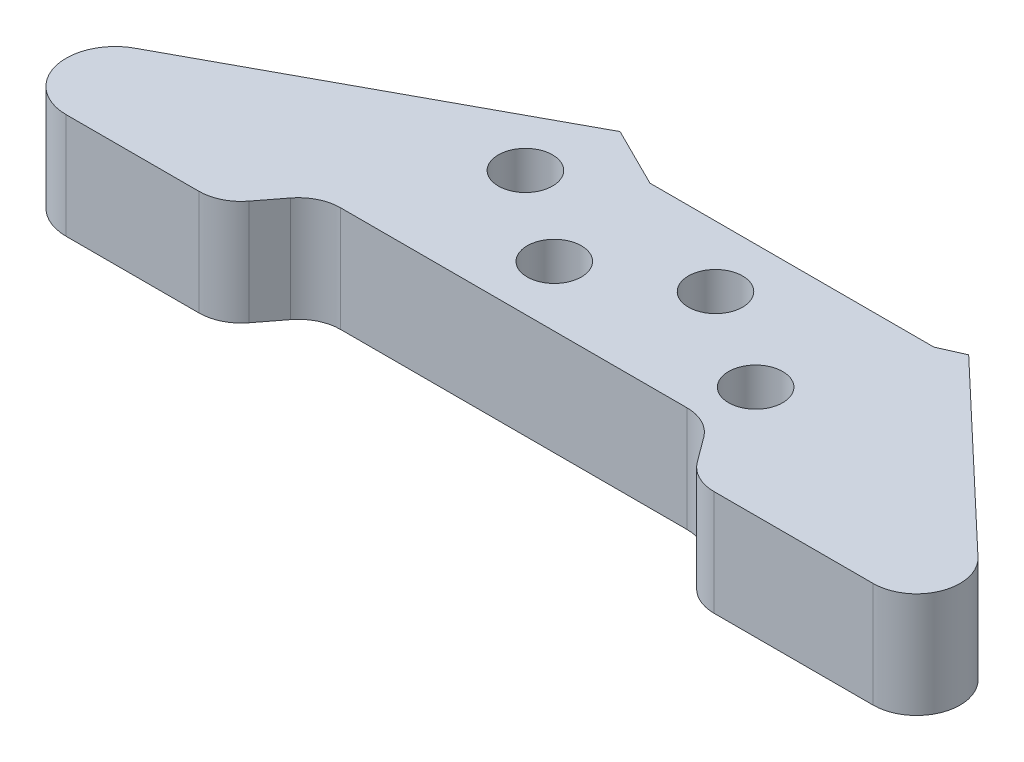
ISO-10303-21;
HEADER;
FILE_DESCRIPTION(('STEP AP214'),'2;1');
FILE_NAME('part.step','',(''),(''),'','','');
FILE_SCHEMA(('AUTOMOTIVE_DESIGN { 1 0 10303 214 1 1 1 1 }'));
ENDSEC;
DATA;
#1=APPLICATION_CONTEXT('core data for automotive mechanical design processes');
#2=APPLICATION_PROTOCOL_DEFINITION('international standard','automotive_design',2000,#1);
#3=PRODUCT_CONTEXT('',#1,'mechanical');
#4=PRODUCT('Part','Part','',(#3));
#5=PRODUCT_RELATED_PRODUCT_CATEGORY('part','',(#4));
#6=PRODUCT_DEFINITION_FORMATION('','',#4);
#7=PRODUCT_DEFINITION_CONTEXT('part definition',#1,'design');
#8=PRODUCT_DEFINITION('design','',#6,#7);
#9=PRODUCT_DEFINITION_SHAPE('','',#8);
#10=(LENGTH_UNIT() NAMED_UNIT(*) SI_UNIT(.MILLI.,.METRE.));
#11=(NAMED_UNIT(*) PLANE_ANGLE_UNIT() SI_UNIT($,.RADIAN.));
#12=(NAMED_UNIT(*) SI_UNIT($,.STERADIAN.) SOLID_ANGLE_UNIT());
#13=UNCERTAINTY_MEASURE_WITH_UNIT(LENGTH_MEASURE(1.E-05),#10,'distance_accuracy_value','');
#14=(GEOMETRIC_REPRESENTATION_CONTEXT(3) GLOBAL_UNCERTAINTY_ASSIGNED_CONTEXT((#13)) GLOBAL_UNIT_ASSIGNED_CONTEXT((#10,
#11,#12)) REPRESENTATION_CONTEXT('',''));
#15=CARTESIAN_POINT('',(0.,0.,0.));
#16=DIRECTION('',(0.,0.,1.));
#17=DIRECTION('',(1.,0.,0.));
#18=AXIS2_PLACEMENT_3D('',#15,#16,#17);
#19=CARTESIAN_POINT('',(94.6464873577747,12.7,72.0035423667846));
#20=DIRECTION('',(0.,-1.,0.));
#21=DIRECTION('',(0.,0.,-1.));
#22=AXIS2_PLACEMENT_3D('',#19,#20,#21);
#23=PLANE('',#22);
#24=CARTESIAN_POINT('',(84.2377296989938,12.7,53.0770811690459));
#25=DIRECTION('',(0.,1.,0.));
#26=DIRECTION('',(0.,0.,1.));
#27=AXIS2_PLACEMENT_3D('',#24,#25,#26);
#28=CIRCLE('',#27,3.2639);
#29=CARTESIAN_POINT('',(84.2377296989938,12.7,56.3409811690459));
#30=VERTEX_POINT('',#29);
#31=EDGE_CURVE('E344',#30,#30,#28,.T.);
#32=ORIENTED_EDGE('',*,*,#31,.F.);
#33=EDGE_LOOP('',(#32));
#34=FACE_BOUND('',#33,.T.);
#35=CARTESIAN_POINT('',(60.1501706674325,12.7,51.8912018263475));
#36=DIRECTION('',(0.,1.,0.));
#37=DIRECTION('',(0.,0.,1.));
#38=AXIS2_PLACEMENT_3D('',#35,#36,#37);
#39=CIRCLE('',#38,3.2639);
#40=CARTESIAN_POINT('',(60.1501706674325,12.7,55.1551018263475));
#41=VERTEX_POINT('',#40);
#42=EDGE_CURVE('E182',#41,#41,#39,.T.);
#43=ORIENTED_EDGE('',*,*,#42,.F.);
#44=EDGE_LOOP('',(#43));
#45=FACE_BOUND('',#44,.T.);
#46=CARTESIAN_POINT('',(94.6464873577747,12.7,72.0035423667846));
#47=DIRECTION('',(0.,-1.,0.));
#48=DIRECTION('',(0.,0.,-1.));
#49=AXIS2_PLACEMENT_3D('',#46,#47,#48);
#50=CIRCLE('',#49,5.07999999999994);
#51=CARTESIAN_POINT('',(94.6464873577746,12.7,66.9235423667847));
#52=VERTEX_POINT('',#51);
#53=CARTESIAN_POINT('',(98.7330315728584,12.7,68.9858352275538));
#54=VERTEX_POINT('',#53);
#55=EDGE_CURVE('E209',#52,#54,#50,.T.);
#56=ORIENTED_EDGE('',*,*,#55,.T.);
#57=DIRECTION('',(0.594036838431286,0.,0.804437837614916));
#58=VECTOR('',#57,1.);
#59=CARTESIAN_POINT('',(98.7330315728584,12.7,68.9858352275538));
#60=LINE('',#59,#58);
#61=CARTESIAN_POINT('',(100.942599671675,12.7,71.9780068716037));
#62=VERTEX_POINT('',#61);
#63=EDGE_CURVE('E117',#54,#62,#60,.T.);
#64=ORIENTED_EDGE('',*,*,#63,.T.);
#65=CARTESIAN_POINT('',(105.029143886759,12.7,68.9602997323728));
#66=DIRECTION('',(0.,1.,0.));
#67=DIRECTION('',(0.,0.,1.));
#68=AXIS2_PLACEMENT_3D('',#65,#66,#67);
#69=CIRCLE('',#68,5.08000000000005);
#70=CARTESIAN_POINT('',(105.029143886759,12.7,74.0402997323728));
#71=VERTEX_POINT('',#70);
#72=EDGE_CURVE('E248',#62,#71,#69,.T.);
#73=ORIENTED_EDGE('',*,*,#72,.T.);
#74=DIRECTION('',(1.,0.,0.));
#75=VECTOR('',#74,1.);
#76=CARTESIAN_POINT('',(124.201892168359,12.7,74.0402997323728));
#77=LINE('',#76,#75);
#78=CARTESIAN_POINT('',(124.201892168359,12.7,74.0402997323728));
#79=VERTEX_POINT('',#78);
#80=EDGE_CURVE('E267',#71,#79,#77,.T.);
#81=ORIENTED_EDGE('',*,*,#80,.T.);
#82=CARTESIAN_POINT('',(124.201892168359,12.7,68.8073629089904));
#83=DIRECTION('',(0.,1.,0.));
#84=DIRECTION('',(0.,0.,-1.));
#85=AXIS2_PLACEMENT_3D('',#82,#83,#84);
#86=CIRCLE('',#85,5.23293682338238);
#87=CARTESIAN_POINT('',(127.802444271928,12.7,65.0100411755846));
#88=VERTEX_POINT('',#87);
#89=EDGE_CURVE('E264',#79,#88,#86,.T.);
#90=ORIENTED_EDGE('',*,*,#89,.T.);
#91=DIRECTION('',(-0.725657859356962,0.,-0.688055718058843));
#92=VECTOR('',#91,1.);
#93=CARTESIAN_POINT('',(106.094318665157,12.7,44.4267872915648));
#94=LINE('',#93,#92);
#95=CARTESIAN_POINT('',(106.094318665157,12.7,44.4267872915648));
#96=VERTEX_POINT('',#95);
#97=EDGE_CURVE('E266',#88,#96,#94,.T.);
#98=ORIENTED_EDGE('',*,*,#97,.T.);
#99=DIRECTION('',(-0.913865355224229,0.,0.406017379579858));
#100=VECTOR('',#99,1.);
#101=CARTESIAN_POINT('',(103.198208610252,12.7,45.7134877980947));
#102=LINE('',#101,#100);
#103=CARTESIAN_POINT('',(103.198208610252,12.7,45.7134877980947));
#104=VERTEX_POINT('',#103);
#105=EDGE_CURVE('E269',#96,#104,#102,.T.);
#106=ORIENTED_EDGE('',*,*,#105,.T.);
#107=DIRECTION('',(-1.,0.,0.));
#108=VECTOR('',#107,1.);
#109=CARTESIAN_POINT('',(68.9773529785824,12.7,45.7134877980947));
#110=LINE('',#109,#108);
#111=CARTESIAN_POINT('',(68.9773529785824,12.7,45.7134877980947));
#112=VERTEX_POINT('',#111);
#113=EDGE_CURVE('E275',#104,#112,#110,.T.);
#114=ORIENTED_EDGE('',*,*,#113,.T.);
#115=DIRECTION('',(-0.894952635956542,0.,-0.446161158545247));
#116=VECTOR('',#115,1.);
#117=CARTESIAN_POINT('',(61.7923746069424,12.7,42.1315571510195));
#118=LINE('',#117,#116);
#119=CARTESIAN_POINT('',(61.7923746069424,12.7,42.1315571510195));
#120=VERTEX_POINT('',#119);
#121=EDGE_CURVE('E277',#112,#120,#118,.T.);
#122=ORIENTED_EDGE('',*,*,#121,.T.);
#123=DIRECTION('',(-0.879472036530174,0.,0.475950561467751));
#124=VECTOR('',#123,1.);
#125=CARTESIAN_POINT('',(61.7923746069424,12.7,42.1315571510195));
#126=LINE('',#125,#124);
#127=CARTESIAN_POINT('',(24.0382702458986,12.7,62.5632325448674));
#128=VERTEX_POINT('',#127);
#129=EDGE_CURVE('E279',#120,#128,#126,.T.);
#130=ORIENTED_EDGE('',*,*,#129,.T.);
#131=CARTESIAN_POINT('',(26.6540797968947,12.7,67.8447610872686));
#132=DIRECTION('',(0.,1.,0.));
#133=DIRECTION('',(0.,0.,1.));
#134=AXIS2_PLACEMENT_3D('',#131,#132,#133);
#135=CIRCLE('',#134,5.89381059682794);
#136=CARTESIAN_POINT('',(26.6540797968947,12.7,73.7385716840965));
#137=VERTEX_POINT('',#136);
#138=EDGE_CURVE('E281',#128,#137,#135,.T.);
#139=ORIENTED_EDGE('',*,*,#138,.T.);
#140=DIRECTION('',(1.,0.,0.));
#141=VECTOR('',#140,1.);
#142=CARTESIAN_POINT('',(26.6540797968947,12.7,73.7385716840965));
#143=LINE('',#142,#141);
#144=CARTESIAN_POINT('',(42.6586117448698,12.7,73.7385716840965));
#145=VERTEX_POINT('',#144);
#146=EDGE_CURVE('E283',#137,#145,#143,.T.);
#147=ORIENTED_EDGE('',*,*,#146,.T.);
#148=CARTESIAN_POINT('',(42.6586117448698,12.7,68.6585716840965));
#149=DIRECTION('',(0.,1.,0.));
#150=DIRECTION('',(0.,0.,1.));
#151=AXIS2_PLACEMENT_3D('',#148,#149,#150);
#152=CIRCLE('',#151,5.08000000000001);
#153=CARTESIAN_POINT('',(46.6879320267667,12.7,71.7522714216106));
#154=VERTEX_POINT('',#153);
#155=EDGE_CURVE('E160',#145,#154,#152,.T.);
#156=ORIENTED_EDGE('',*,*,#155,.T.);
#157=DIRECTION('',(0.608996011321672,0.,-0.793173283837961));
#158=VECTOR('',#157,1.);
#159=CARTESIAN_POINT('',(46.6879320267667,12.7,71.7522714216106));
#160=LINE('',#159,#158);
#161=CARTESIAN_POINT('',(48.8703401238031,12.7,68.9098426292706));
#162=VERTEX_POINT('',#161);
#163=EDGE_CURVE('E154',#154,#162,#160,.T.);
#164=ORIENTED_EDGE('',*,*,#163,.T.);
#165=CARTESIAN_POINT('',(52.8996604057,12.7,72.0035423667847));
#166=DIRECTION('',(0.,-1.,0.));
#167=DIRECTION('',(0.,0.,1.));
#168=AXIS2_PLACEMENT_3D('',#165,#166,#167);
#169=CIRCLE('',#168,5.08000000000004);
#170=CARTESIAN_POINT('',(52.8996604057,12.7,66.9235423667847));
#171=VERTEX_POINT('',#170);
#172=EDGE_CURVE('E158',#162,#171,#169,.T.);
#173=ORIENTED_EDGE('',*,*,#172,.T.);
#174=DIRECTION('',(1.,0.,0.));
#175=VECTOR('',#174,1.);
#176=CARTESIAN_POINT('',(52.8996604057,12.7,66.9235423667847));
#177=LINE('',#176,#175);
#178=EDGE_CURVE('E50',#171,#52,#177,.T.);
#179=ORIENTED_EDGE('',*,*,#178,.T.);
#180=EDGE_LOOP('',(#56,#64,#73,#81,#90,#98,#106,#114,#122,#130,#139,#147,#156,#164,#173,#179));
#181=FACE_BOUND('',#180,.T.);
#182=CARTESIAN_POINT('',(71.3764155997683,12.7,59.6418498954581));
#183=DIRECTION('',(0.,1.,0.));
#184=DIRECTION('',(0.,0.,1.));
#185=AXIS2_PLACEMENT_3D('',#182,#183,#184);
#186=CIRCLE('',#185,3.2639);
#187=CARTESIAN_POINT('',(71.3764155997683,12.7,62.9057498954581));
#188=VERTEX_POINT('',#187);
#189=EDGE_CURVE('E350',#188,#188,#186,.T.);
#190=ORIENTED_EDGE('',*,*,#189,.F.);
#191=EDGE_LOOP('',(#190));
#192=FACE_BOUND('',#191,.T.);
#193=CARTESIAN_POINT('',(96.6302897601921,12.7,60.6336217308192));
#194=DIRECTION('',(0.,1.,0.));
#195=DIRECTION('',(0.,0.,1.));
#196=AXIS2_PLACEMENT_3D('',#193,#194,#195);
#197=CIRCLE('',#196,3.2639);
#198=CARTESIAN_POINT('',(96.6302897601921,12.7,63.8975217308192));
#199=VERTEX_POINT('',#198);
#200=EDGE_CURVE('E335',#199,#199,#197,.T.);
#201=ORIENTED_EDGE('',*,*,#200,.F.);
#202=EDGE_LOOP('',(#201));
#203=FACE_BOUND('',#202,.T.);
#204=ADVANCED_FACE('F33',(#34,#45,#181,#192,#203),#23,.F.);
#205=CARTESIAN_POINT('',(94.6464873577747,0.,72.0035423667846));
#206=DIRECTION('',(0.,-1.,0.));
#207=DIRECTION('',(0.,0.,-1.));
#208=AXIS2_PLACEMENT_3D('',#205,#206,#207);
#209=PLANE('',#208);
#210=CARTESIAN_POINT('',(84.2377296989938,0.,53.0770811690459));
#211=DIRECTION('',(0.,1.,0.));
#212=DIRECTION('',(0.,0.,1.));
#213=AXIS2_PLACEMENT_3D('',#210,#211,#212);
#214=CIRCLE('',#213,3.2639);
#215=CARTESIAN_POINT('',(84.2377296989938,0.,56.3409811690459));
#216=VERTEX_POINT('',#215);
#217=EDGE_CURVE('E341',#216,#216,#214,.T.);
#218=ORIENTED_EDGE('',*,*,#217,.T.);
#219=EDGE_LOOP('',(#218));
#220=FACE_BOUND('',#219,.T.);
#221=CARTESIAN_POINT('',(60.1501706674325,0.,51.8912018263475));
#222=DIRECTION('',(0.,1.,0.));
#223=DIRECTION('',(0.,0.,1.));
#224=AXIS2_PLACEMENT_3D('',#221,#222,#223);
#225=CIRCLE('',#224,3.2639);
#226=CARTESIAN_POINT('',(60.1501706674325,0.,55.1551018263475));
#227=VERTEX_POINT('',#226);
#228=EDGE_CURVE('E353',#227,#227,#225,.T.);
#229=ORIENTED_EDGE('',*,*,#228,.T.);
#230=EDGE_LOOP('',(#229));
#231=FACE_BOUND('',#230,.T.);
#232=CARTESIAN_POINT('',(94.6464873577747,0.,72.0035423667846));
#233=DIRECTION('',(0.,-1.,0.));
#234=DIRECTION('',(0.,0.,-1.));
#235=AXIS2_PLACEMENT_3D('',#232,#233,#234);
#236=CIRCLE('',#235,5.07999999999994);
#237=CARTESIAN_POINT('',(94.6464873577746,0.,66.9235423667847));
#238=VERTEX_POINT('',#237);
#239=CARTESIAN_POINT('',(98.7330315728584,0.,68.9858352275538));
#240=VERTEX_POINT('',#239);
#241=EDGE_CURVE('E178',#238,#240,#236,.T.);
#242=ORIENTED_EDGE('',*,*,#241,.F.);
#243=DIRECTION('',(1.,0.,0.));
#244=VECTOR('',#243,1.);
#245=CARTESIAN_POINT('',(52.8996604057,0.,66.9235423667847));
#246=LINE('',#245,#244);
#247=CARTESIAN_POINT('',(52.8996604057,0.,66.9235423667847));
#248=VERTEX_POINT('',#247);
#249=EDGE_CURVE('E109',#248,#238,#246,.T.);
#250=ORIENTED_EDGE('',*,*,#249,.F.);
#251=CARTESIAN_POINT('',(52.8996604057,0.,72.0035423667847));
#252=DIRECTION('',(0.,-1.,0.));
#253=DIRECTION('',(0.,0.,1.));
#254=AXIS2_PLACEMENT_3D('',#251,#252,#253);
#255=CIRCLE('',#254,5.08000000000004);
#256=CARTESIAN_POINT('',(48.8703401238031,0.,68.9098426292706));
#257=VERTEX_POINT('',#256);
#258=EDGE_CURVE('E103',#257,#248,#255,.T.);
#259=ORIENTED_EDGE('',*,*,#258,.F.);
#260=DIRECTION('',(0.608996011321672,0.,-0.793173283837961));
#261=VECTOR('',#260,1.);
#262=CARTESIAN_POINT('',(46.6879320267667,0.,71.7522714216106));
#263=LINE('',#262,#261);
#264=CARTESIAN_POINT('',(46.6879320267667,0.,71.7522714216106));
#265=VERTEX_POINT('',#264);
#266=EDGE_CURVE('E168',#265,#257,#263,.T.);
#267=ORIENTED_EDGE('',*,*,#266,.F.);
#268=CARTESIAN_POINT('',(42.6586117448698,0.,68.6585716840965));
#269=DIRECTION('',(0.,1.,0.));
#270=DIRECTION('',(0.,0.,1.));
#271=AXIS2_PLACEMENT_3D('',#268,#269,#270);
#272=CIRCLE('',#271,5.08000000000001);
#273=CARTESIAN_POINT('',(42.6586117448698,0.,73.7385716840965));
#274=VERTEX_POINT('',#273);
#275=EDGE_CURVE('E204',#274,#265,#272,.T.);
#276=ORIENTED_EDGE('',*,*,#275,.F.);
#277=DIRECTION('',(1.,0.,0.));
#278=VECTOR('',#277,1.);
#279=CARTESIAN_POINT('',(26.6540797968947,0.,73.7385716840965));
#280=LINE('',#279,#278);
#281=CARTESIAN_POINT('',(26.6540797968947,0.,73.7385716840965));
#282=VERTEX_POINT('',#281);
#283=EDGE_CURVE('E202',#282,#274,#280,.T.);
#284=ORIENTED_EDGE('',*,*,#283,.F.);
#285=CARTESIAN_POINT('',(26.6540797968947,0.,67.8447610872686));
#286=DIRECTION('',(0.,1.,0.));
#287=DIRECTION('',(0.,0.,1.));
#288=AXIS2_PLACEMENT_3D('',#285,#286,#287);
#289=CIRCLE('',#288,5.89381059682794);
#290=CARTESIAN_POINT('',(24.0382702458986,0.,62.5632325448674));
#291=VERTEX_POINT('',#290);
#292=EDGE_CURVE('E200',#291,#282,#289,.T.);
#293=ORIENTED_EDGE('',*,*,#292,.F.);
#294=DIRECTION('',(-0.879472036530174,0.,0.475950561467751));
#295=VECTOR('',#294,1.);
#296=CARTESIAN_POINT('',(61.7923746069424,0.,42.1315571510195));
#297=LINE('',#296,#295);
#298=CARTESIAN_POINT('',(61.7923746069424,0.,42.1315571510195));
#299=VERTEX_POINT('',#298);
#300=EDGE_CURVE('E198',#299,#291,#297,.T.);
#301=ORIENTED_EDGE('',*,*,#300,.F.);
#302=DIRECTION('',(-0.894952635956542,0.,-0.446161158545247));
#303=VECTOR('',#302,1.);
#304=CARTESIAN_POINT('',(61.7923746069424,0.,42.1315571510195));
#305=LINE('',#304,#303);
#306=CARTESIAN_POINT('',(68.9773529785824,0.,45.7134877980947));
#307=VERTEX_POINT('',#306);
#308=EDGE_CURVE('E196',#307,#299,#305,.T.);
#309=ORIENTED_EDGE('',*,*,#308,.F.);
#310=DIRECTION('',(-1.,0.,0.));
#311=VECTOR('',#310,1.);
#312=CARTESIAN_POINT('',(68.9773529785824,0.,45.7134877980947));
#313=LINE('',#312,#311);
#314=CARTESIAN_POINT('',(103.198208610252,0.,45.7134877980947));
#315=VERTEX_POINT('',#314);
#316=EDGE_CURVE('E194',#315,#307,#313,.T.);
#317=ORIENTED_EDGE('',*,*,#316,.F.);
#318=DIRECTION('',(-0.913865355224229,0.,0.406017379579858));
#319=VECTOR('',#318,1.);
#320=CARTESIAN_POINT('',(103.198208610252,0.,45.7134877980947));
#321=LINE('',#320,#319);
#322=CARTESIAN_POINT('',(106.094318665157,0.,44.4267872915648));
#323=VERTEX_POINT('',#322);
#324=EDGE_CURVE('E192',#323,#315,#321,.T.);
#325=ORIENTED_EDGE('',*,*,#324,.F.);
#326=DIRECTION('',(-0.725657859356962,0.,-0.688055718058843));
#327=VECTOR('',#326,1.);
#328=CARTESIAN_POINT('',(106.094318665157,0.,44.4267872915648));
#329=LINE('',#328,#327);
#330=CARTESIAN_POINT('',(127.802444271928,0.,65.0100411755846));
#331=VERTEX_POINT('',#330);
#332=EDGE_CURVE('E190',#331,#323,#329,.T.);
#333=ORIENTED_EDGE('',*,*,#332,.F.);
#334=CARTESIAN_POINT('',(124.201892168359,0.,68.8073629089904));
#335=DIRECTION('',(0.,1.,0.));
#336=DIRECTION('',(0.,0.,-1.));
#337=AXIS2_PLACEMENT_3D('',#334,#335,#336);
#338=CIRCLE('',#337,5.23293682338238);
#339=CARTESIAN_POINT('',(124.201892168359,0.,74.0402997323728));
#340=VERTEX_POINT('',#339);
#341=EDGE_CURVE('E188',#340,#331,#338,.T.);
#342=ORIENTED_EDGE('',*,*,#341,.F.);
#343=DIRECTION('',(1.,0.,0.));
#344=VECTOR('',#343,1.);
#345=CARTESIAN_POINT('',(124.201892168359,0.,74.0402997323728));
#346=LINE('',#345,#344);
#347=CARTESIAN_POINT('',(105.029143886759,0.,74.0402997323728));
#348=VERTEX_POINT('',#347);
#349=EDGE_CURVE('E186',#348,#340,#346,.T.);
#350=ORIENTED_EDGE('',*,*,#349,.F.);
#351=CARTESIAN_POINT('',(105.029143886759,0.,68.9602997323728));
#352=DIRECTION('',(0.,1.,0.));
#353=DIRECTION('',(0.,0.,1.));
#354=AXIS2_PLACEMENT_3D('',#351,#352,#353);
#355=CIRCLE('',#354,5.08000000000005);
#356=CARTESIAN_POINT('',(100.942599671675,0.,71.9780068716037));
#357=VERTEX_POINT('',#356);
#358=EDGE_CURVE('E184',#357,#348,#355,.T.);
#359=ORIENTED_EDGE('',*,*,#358,.F.);
#360=DIRECTION('',(0.594036838431286,0.,0.804437837614916));
#361=VECTOR('',#360,1.);
#362=CARTESIAN_POINT('',(98.7330315728584,0.,68.9858352275538));
#363=LINE('',#362,#361);
#364=EDGE_CURVE('E181',#240,#357,#363,.T.);
#365=ORIENTED_EDGE('',*,*,#364,.F.);
#366=EDGE_LOOP('',(#242,#250,#259,#267,#276,#284,#293,#301,#309,#317,#325,#333,#342,#350,#359,#365));
#367=FACE_BOUND('',#366,.T.);
#368=CARTESIAN_POINT('',(71.3764155997683,0.,59.6418498954581));
#369=DIRECTION('',(0.,1.,0.));
#370=DIRECTION('',(0.,0.,1.));
#371=AXIS2_PLACEMENT_3D('',#368,#369,#370);
#372=CIRCLE('',#371,3.2639);
#373=CARTESIAN_POINT('',(71.3764155997683,0.,62.9057498954581));
#374=VERTEX_POINT('',#373);
#375=EDGE_CURVE('E347',#374,#374,#372,.T.);
#376=ORIENTED_EDGE('',*,*,#375,.T.);
#377=EDGE_LOOP('',(#376));
#378=FACE_BOUND('',#377,.T.);
#379=CARTESIAN_POINT('',(96.6302897601921,0.,60.6336217308192));
#380=DIRECTION('',(0.,1.,0.));
#381=DIRECTION('',(0.,0.,1.));
#382=AXIS2_PLACEMENT_3D('',#379,#380,#381);
#383=CIRCLE('',#382,3.2639);
#384=CARTESIAN_POINT('',(96.6302897601921,0.,63.8975217308192));
#385=VERTEX_POINT('',#384);
#386=EDGE_CURVE('E338',#385,#385,#383,.T.);
#387=ORIENTED_EDGE('',*,*,#386,.T.);
#388=EDGE_LOOP('',(#387));
#389=FACE_BOUND('',#388,.T.);
#390=ADVANCED_FACE('F252',(#220,#231,#367,#378,#389),#209,.T.);
#391=CARTESIAN_POINT('',(94.6464873577747,12.7,72.0035423667846));
#392=DIRECTION('',(0.,-1.,0.));
#393=DIRECTION('',(0.,0.,-1.));
#394=AXIS2_PLACEMENT_3D('',#391,#392,#393);
#395=CYLINDRICAL_SURFACE('',#394,5.07999999999994);
#396=ORIENTED_EDGE('',*,*,#241,.T.);
#397=DIRECTION('',(0.,-1.,0.));
#398=VECTOR('',#397,1.);
#399=CARTESIAN_POINT('',(98.7330315728584,12.7,68.9858352275538));
#400=LINE('',#399,#398);
#401=EDGE_CURVE('E11',#54,#240,#400,.T.);
#402=ORIENTED_EDGE('',*,*,#401,.F.);
#403=ORIENTED_EDGE('',*,*,#55,.F.);
#404=DIRECTION('',(0.,-1.,0.));
#405=VECTOR('',#404,1.);
#406=CARTESIAN_POINT('',(94.6464873577746,12.7,66.9235423667847));
#407=LINE('',#406,#405);
#408=EDGE_CURVE('E174',#52,#238,#407,.T.);
#409=ORIENTED_EDGE('',*,*,#408,.T.);
#410=EDGE_LOOP('',(#396,#402,#403,#409));
#411=FACE_BOUND('',#410,.T.);
#412=ADVANCED_FACE('F35',(#411),#395,.F.);
#413=CARTESIAN_POINT('',(98.7330315728584,12.7,68.9858352275538));
#414=DIRECTION('',(0.804437837614916,0.,-0.594036838431286));
#415=DIRECTION('',(-0.594036838431286,0.,-0.804437837614916));
#416=AXIS2_PLACEMENT_3D('',#413,#414,#415);
#417=PLANE('',#416);
#418=ORIENTED_EDGE('',*,*,#364,.T.);
#419=DIRECTION('',(0.,-1.,0.));
#420=VECTOR('',#419,1.);
#421=CARTESIAN_POINT('',(100.942599671675,12.7,71.9780068716037));
#422=LINE('',#421,#420);
#423=EDGE_CURVE('E42',#62,#357,#422,.T.);
#424=ORIENTED_EDGE('',*,*,#423,.F.);
#425=ORIENTED_EDGE('',*,*,#63,.F.);
#426=ORIENTED_EDGE('',*,*,#401,.T.);
#427=EDGE_LOOP('',(#418,#424,#425,#426));
#428=FACE_BOUND('',#427,.T.);
#429=ADVANCED_FACE('F502',(#428),#417,.F.);
#430=CARTESIAN_POINT('',(105.029143886759,12.7,68.9602997323728));
#431=DIRECTION('',(0.,-1.,0.));
#432=DIRECTION('',(0.,0.,-1.));
#433=AXIS2_PLACEMENT_3D('',#430,#431,#432);
#434=CYLINDRICAL_SURFACE('',#433,5.08000000000005);
#435=ORIENTED_EDGE('',*,*,#358,.T.);
#436=DIRECTION('',(0.,-1.,0.));
#437=VECTOR('',#436,1.);
#438=CARTESIAN_POINT('',(105.029143886759,12.7,74.0402997323728));
#439=LINE('',#438,#437);
#440=EDGE_CURVE('E240',#71,#348,#439,.T.);
#441=ORIENTED_EDGE('',*,*,#440,.F.);
#442=ORIENTED_EDGE('',*,*,#72,.F.);
#443=ORIENTED_EDGE('',*,*,#423,.T.);
#444=EDGE_LOOP('',(#435,#441,#442,#443));
#445=FACE_BOUND('',#444,.T.);
#446=ADVANCED_FACE('F246',(#445),#434,.T.);
#447=CARTESIAN_POINT('',(124.201892168359,12.7,74.0402997323728));
#448=DIRECTION('',(0.,0.,-1.));
#449=DIRECTION('',(-1.,0.,0.));
#450=AXIS2_PLACEMENT_3D('',#447,#448,#449);
#451=PLANE('',#450);
#452=ORIENTED_EDGE('',*,*,#349,.T.);
#453=DIRECTION('',(0.,-1.,0.));
#454=VECTOR('',#453,1.);
#455=CARTESIAN_POINT('',(124.201892168359,12.7,74.0402997323728));
#456=LINE('',#455,#454);
#457=EDGE_CURVE('E237',#79,#340,#456,.T.);
#458=ORIENTED_EDGE('',*,*,#457,.F.);
#459=ORIENTED_EDGE('',*,*,#80,.F.);
#460=ORIENTED_EDGE('',*,*,#440,.T.);
#461=EDGE_LOOP('',(#452,#458,#459,#460));
#462=FACE_BOUND('',#461,.T.);
#463=ADVANCED_FACE('F258',(#462),#451,.F.);
#464=CARTESIAN_POINT('',(124.201892168359,12.7,68.8073629089904));
#465=DIRECTION('',(0.,-1.,0.));
#466=DIRECTION('',(0.,0.,-1.));
#467=AXIS2_PLACEMENT_3D('',#464,#465,#466);
#468=CYLINDRICAL_SURFACE('',#467,5.23293682338238);
#469=ORIENTED_EDGE('',*,*,#341,.T.);
#470=DIRECTION('',(0.,-1.,0.));
#471=VECTOR('',#470,1.);
#472=CARTESIAN_POINT('',(127.802444271928,12.7,65.0100411755846));
#473=LINE('',#472,#471);
#474=EDGE_CURVE('E234',#88,#331,#473,.T.);
#475=ORIENTED_EDGE('',*,*,#474,.F.);
#476=ORIENTED_EDGE('',*,*,#89,.F.);
#477=ORIENTED_EDGE('',*,*,#457,.T.);
#478=EDGE_LOOP('',(#469,#475,#476,#477));
#479=FACE_BOUND('',#478,.T.);
#480=ADVANCED_FACE('F262',(#479),#468,.T.);
#481=CARTESIAN_POINT('',(106.094318665157,12.7,44.4267872915648));
#482=DIRECTION('',(-0.688055718058844,0.,0.725657859356962));
#483=DIRECTION('',(0.725657859356962,0.,0.688055718058844));
#484=AXIS2_PLACEMENT_3D('',#481,#482,#483);
#485=PLANE('',#484);
#486=ORIENTED_EDGE('',*,*,#332,.T.);
#487=DIRECTION('',(0.,-1.,0.));
#488=VECTOR('',#487,1.);
#489=CARTESIAN_POINT('',(106.094318665157,12.7,44.4267872915648));
#490=LINE('',#489,#488);
#491=EDGE_CURVE('E231',#96,#323,#490,.T.);
#492=ORIENTED_EDGE('',*,*,#491,.F.);
#493=ORIENTED_EDGE('',*,*,#97,.F.);
#494=ORIENTED_EDGE('',*,*,#474,.T.);
#495=EDGE_LOOP('',(#486,#492,#493,#494));
#496=FACE_BOUND('',#495,.T.);
#497=ADVANCED_FACE('F467',(#496),#485,.F.);
#498=CARTESIAN_POINT('',(103.198208610252,12.7,45.7134877980947));
#499=DIRECTION('',(0.406017379579858,0.,0.913865355224229));
#500=DIRECTION('',(0.913865355224229,0.,-0.406017379579858));
#501=AXIS2_PLACEMENT_3D('',#498,#499,#500);
#502=PLANE('',#501);
#503=ORIENTED_EDGE('',*,*,#324,.T.);
#504=DIRECTION('',(0.,-1.,0.));
#505=VECTOR('',#504,1.);
#506=CARTESIAN_POINT('',(103.198208610252,12.7,45.7134877980947));
#507=LINE('',#506,#505);
#508=EDGE_CURVE('E228',#104,#315,#507,.T.);
#509=ORIENTED_EDGE('',*,*,#508,.F.);
#510=ORIENTED_EDGE('',*,*,#105,.F.);
#511=ORIENTED_EDGE('',*,*,#491,.T.);
#512=EDGE_LOOP('',(#503,#509,#510,#511));
#513=FACE_BOUND('',#512,.T.);
#514=ADVANCED_FACE('F457',(#513),#502,.F.);
#515=CARTESIAN_POINT('',(68.9773529785824,12.7,45.7134877980947));
#516=DIRECTION('',(0.,0.,1.));
#517=DIRECTION('',(1.,0.,0.));
#518=AXIS2_PLACEMENT_3D('',#515,#516,#517);
#519=PLANE('',#518);
#520=ORIENTED_EDGE('',*,*,#316,.T.);
#521=DIRECTION('',(0.,-1.,0.));
#522=VECTOR('',#521,1.);
#523=CARTESIAN_POINT('',(68.9773529785824,12.7,45.7134877980947));
#524=LINE('',#523,#522);
#525=EDGE_CURVE('E225',#112,#307,#524,.T.);
#526=ORIENTED_EDGE('',*,*,#525,.F.);
#527=ORIENTED_EDGE('',*,*,#113,.F.);
#528=ORIENTED_EDGE('',*,*,#508,.T.);
#529=EDGE_LOOP('',(#520,#526,#527,#528));
#530=FACE_BOUND('',#529,.T.);
#531=ADVANCED_FACE('F447',(#530),#519,.F.);
#532=CARTESIAN_POINT('',(61.7923746069424,12.7,42.1315571510195));
#533=DIRECTION('',(-0.446161158545247,0.,0.894952635956542));
#534=DIRECTION('',(0.894952635956542,0.,0.446161158545247));
#535=AXIS2_PLACEMENT_3D('',#532,#533,#534);
#536=PLANE('',#535);
#537=ORIENTED_EDGE('',*,*,#308,.T.);
#538=DIRECTION('',(0.,-1.,0.));
#539=VECTOR('',#538,1.);
#540=CARTESIAN_POINT('',(61.7923746069424,12.7,42.1315571510195));
#541=LINE('',#540,#539);
#542=EDGE_CURVE('E222',#120,#299,#541,.T.);
#543=ORIENTED_EDGE('',*,*,#542,.F.);
#544=ORIENTED_EDGE('',*,*,#121,.F.);
#545=ORIENTED_EDGE('',*,*,#525,.T.);
#546=EDGE_LOOP('',(#537,#543,#544,#545));
#547=FACE_BOUND('',#546,.T.);
#548=ADVANCED_FACE('F437',(#547),#536,.F.);
#549=CARTESIAN_POINT('',(61.7923746069424,12.7,42.1315571510195));
#550=DIRECTION('',(0.475950561467751,0.,0.879472036530174));
#551=DIRECTION('',(0.879472036530175,0.,-0.475950561467751));
#552=AXIS2_PLACEMENT_3D('',#549,#550,#551);
#553=PLANE('',#552);
#554=ORIENTED_EDGE('',*,*,#300,.T.);
#555=DIRECTION('',(0.,-1.,0.));
#556=VECTOR('',#555,1.);
#557=CARTESIAN_POINT('',(24.0382702458986,12.7,62.5632325448674));
#558=LINE('',#557,#556);
#559=EDGE_CURVE('E219',#128,#291,#558,.T.);
#560=ORIENTED_EDGE('',*,*,#559,.F.);
#561=ORIENTED_EDGE('',*,*,#129,.F.);
#562=ORIENTED_EDGE('',*,*,#542,.T.);
#563=EDGE_LOOP('',(#554,#560,#561,#562));
#564=FACE_BOUND('',#563,.T.);
#565=ADVANCED_FACE('F427',(#564),#553,.F.);
#566=CARTESIAN_POINT('',(26.6540797968947,12.7,67.8447610872686));
#567=DIRECTION('',(0.,-1.,0.));
#568=DIRECTION('',(0.,0.,-1.));
#569=AXIS2_PLACEMENT_3D('',#566,#567,#568);
#570=CYLINDRICAL_SURFACE('',#569,5.89381059682794);
#571=ORIENTED_EDGE('',*,*,#292,.T.);
#572=DIRECTION('',(0.,-1.,0.));
#573=VECTOR('',#572,1.);
#574=CARTESIAN_POINT('',(26.6540797968947,12.7,73.7385716840965));
#575=LINE('',#574,#573);
#576=EDGE_CURVE('E216',#137,#282,#575,.T.);
#577=ORIENTED_EDGE('',*,*,#576,.F.);
#578=ORIENTED_EDGE('',*,*,#138,.F.);
#579=ORIENTED_EDGE('',*,*,#559,.T.);
#580=EDGE_LOOP('',(#571,#577,#578,#579));
#581=FACE_BOUND('',#580,.T.);
#582=ADVANCED_FACE('F418',(#581),#570,.T.);
#583=CARTESIAN_POINT('',(26.6540797968947,12.7,73.7385716840965));
#584=DIRECTION('',(0.,0.,-1.));
#585=DIRECTION('',(-1.,0.,0.));
#586=AXIS2_PLACEMENT_3D('',#583,#584,#585);
#587=PLANE('',#586);
#588=ORIENTED_EDGE('',*,*,#283,.T.);
#589=DIRECTION('',(0.,-1.,0.));
#590=VECTOR('',#589,1.);
#591=CARTESIAN_POINT('',(42.6586117448698,12.7,73.7385716840965));
#592=LINE('',#591,#590);
#593=EDGE_CURVE('E213',#145,#274,#592,.T.);
#594=ORIENTED_EDGE('',*,*,#593,.F.);
#595=ORIENTED_EDGE('',*,*,#146,.F.);
#596=ORIENTED_EDGE('',*,*,#576,.T.);
#597=EDGE_LOOP('',(#588,#594,#595,#596));
#598=FACE_BOUND('',#597,.T.);
#599=ADVANCED_FACE('F289',(#598),#587,.F.);
#600=CARTESIAN_POINT('',(42.6586117448698,12.7,68.6585716840965));
#601=DIRECTION('',(0.,-1.,0.));
#602=DIRECTION('',(0.,0.,-1.));
#603=AXIS2_PLACEMENT_3D('',#600,#601,#602);
#604=CYLINDRICAL_SURFACE('',#603,5.08000000000001);
#605=ORIENTED_EDGE('',*,*,#275,.T.);
#606=DIRECTION('',(0.,-1.,0.));
#607=VECTOR('',#606,1.);
#608=CARTESIAN_POINT('',(46.6879320267667,12.7,71.7522714216106));
#609=LINE('',#608,#607);
#610=EDGE_CURVE('E169',#154,#265,#609,.T.);
#611=ORIENTED_EDGE('',*,*,#610,.F.);
#612=ORIENTED_EDGE('',*,*,#155,.F.);
#613=ORIENTED_EDGE('',*,*,#593,.T.);
#614=EDGE_LOOP('',(#605,#611,#612,#613));
#615=FACE_BOUND('',#614,.T.);
#616=ADVANCED_FACE('F293',(#615),#604,.T.);
#617=CARTESIAN_POINT('',(46.6879320267667,12.7,71.7522714216106));
#618=DIRECTION('',(-0.793173283837961,0.,-0.608996011321672));
#619=DIRECTION('',(-0.608996011321672,0.,0.793173283837961));
#620=AXIS2_PLACEMENT_3D('',#617,#618,#619);
#621=PLANE('',#620);
#622=ORIENTED_EDGE('',*,*,#266,.T.);
#623=DIRECTION('',(0.,-1.,0.));
#624=VECTOR('',#623,1.);
#625=CARTESIAN_POINT('',(48.8703401238031,12.7,68.9098426292706));
#626=LINE('',#625,#624);
#627=EDGE_CURVE('E165',#162,#257,#626,.T.);
#628=ORIENTED_EDGE('',*,*,#627,.F.);
#629=ORIENTED_EDGE('',*,*,#163,.F.);
#630=ORIENTED_EDGE('',*,*,#610,.T.);
#631=EDGE_LOOP('',(#622,#628,#629,#630));
#632=FACE_BOUND('',#631,.T.);
#633=ADVANCED_FACE('F166',(#632),#621,.F.);
#634=CARTESIAN_POINT('',(52.8996604057,12.7,72.0035423667847));
#635=DIRECTION('',(0.,-1.,0.));
#636=DIRECTION('',(0.,0.,-1.));
#637=AXIS2_PLACEMENT_3D('',#634,#635,#636);
#638=CYLINDRICAL_SURFACE('',#637,5.08000000000004);
#639=ORIENTED_EDGE('',*,*,#258,.T.);
#640=DIRECTION('',(0.,-1.,0.));
#641=VECTOR('',#640,1.);
#642=CARTESIAN_POINT('',(52.8996604057,12.7,66.9235423667847));
#643=LINE('',#642,#641);
#644=EDGE_CURVE('E170',#171,#248,#643,.T.);
#645=ORIENTED_EDGE('',*,*,#644,.F.);
#646=ORIENTED_EDGE('',*,*,#172,.F.);
#647=ORIENTED_EDGE('',*,*,#627,.T.);
#648=EDGE_LOOP('',(#639,#645,#646,#647));
#649=FACE_BOUND('',#648,.T.);
#650=ADVANCED_FACE('F172',(#649),#638,.F.);
#651=CARTESIAN_POINT('',(52.8996604057,12.7,66.9235423667847));
#652=DIRECTION('',(0.,0.,-1.));
#653=DIRECTION('',(-1.,0.,0.));
#654=AXIS2_PLACEMENT_3D('',#651,#652,#653);
#655=PLANE('',#654);
#656=ORIENTED_EDGE('',*,*,#249,.T.);
#657=ORIENTED_EDGE('',*,*,#408,.F.);
#658=ORIENTED_EDGE('',*,*,#178,.F.);
#659=ORIENTED_EDGE('',*,*,#644,.T.);
#660=EDGE_LOOP('',(#656,#657,#658,#659));
#661=FACE_BOUND('',#660,.T.);
#662=ADVANCED_FACE('F297',(#661),#655,.F.);
#663=CARTESIAN_POINT('',(60.1501706674325,12.7,51.8912018263475));
#664=DIRECTION('',(0.,-1.,0.));
#665=DIRECTION('',(0.,0.,-1.));
#666=AXIS2_PLACEMENT_3D('',#663,#664,#665);
#667=CYLINDRICAL_SURFACE('',#666,3.2639);
#668=ORIENTED_EDGE('',*,*,#42,.T.);
#669=EDGE_LOOP('',(#668));
#670=FACE_BOUND('',#669,.T.);
#671=ORIENTED_EDGE('',*,*,#228,.F.);
#672=EDGE_LOOP('',(#671));
#673=FACE_BOUND('',#672,.T.);
#674=ADVANCED_FACE('F299',(#670,#673),#667,.F.);
#675=CARTESIAN_POINT('',(71.3764155997683,12.7,59.6418498954581));
#676=DIRECTION('',(0.,-1.,0.));
#677=DIRECTION('',(0.,0.,-1.));
#678=AXIS2_PLACEMENT_3D('',#675,#676,#677);
#679=CYLINDRICAL_SURFACE('',#678,3.2639);
#680=ORIENTED_EDGE('',*,*,#189,.T.);
#681=EDGE_LOOP('',(#680));
#682=FACE_BOUND('',#681,.T.);
#683=ORIENTED_EDGE('',*,*,#375,.F.);
#684=EDGE_LOOP('',(#683));
#685=FACE_BOUND('',#684,.T.);
#686=ADVANCED_FACE('F305',(#682,#685),#679,.F.);
#687=CARTESIAN_POINT('',(84.2377296989938,12.7,53.0770811690459));
#688=DIRECTION('',(0.,-1.,0.));
#689=DIRECTION('',(0.,0.,-1.));
#690=AXIS2_PLACEMENT_3D('',#687,#688,#689);
#691=CYLINDRICAL_SURFACE('',#690,3.2639);
#692=ORIENTED_EDGE('',*,*,#31,.T.);
#693=EDGE_LOOP('',(#692));
#694=FACE_BOUND('',#693,.T.);
#695=ORIENTED_EDGE('',*,*,#217,.F.);
#696=EDGE_LOOP('',(#695));
#697=FACE_BOUND('',#696,.T.);
#698=ADVANCED_FACE('F322',(#694,#697),#691,.F.);
#699=CARTESIAN_POINT('',(96.6302897601921,12.7,60.6336217308192));
#700=DIRECTION('',(0.,-1.,0.));
#701=DIRECTION('',(0.,0.,-1.));
#702=AXIS2_PLACEMENT_3D('',#699,#700,#701);
#703=CYLINDRICAL_SURFACE('',#702,3.2639);
#704=ORIENTED_EDGE('',*,*,#200,.T.);
#705=EDGE_LOOP('',(#704));
#706=FACE_BOUND('',#705,.T.);
#707=ORIENTED_EDGE('',*,*,#386,.F.);
#708=EDGE_LOOP('',(#707));
#709=FACE_BOUND('',#708,.T.);
#710=ADVANCED_FACE('F326',(#706,#709),#703,.F.);
#711=CLOSED_SHELL('',(#204,#390,#412,#429,#446,#463,#480,#497,#514,#531,#548,#565,#582,#599,
#616,#633,#650,#662,#674,#686,#698,#710));
#712=MANIFOLD_SOLID_BREP('B2',#711);
#713=ADVANCED_BREP_SHAPE_REPRESENTATION('',(#18,#712),#14);
#714=SHAPE_DEFINITION_REPRESENTATION(#9,#713);
ENDSEC;
END-ISO-10303-21;
